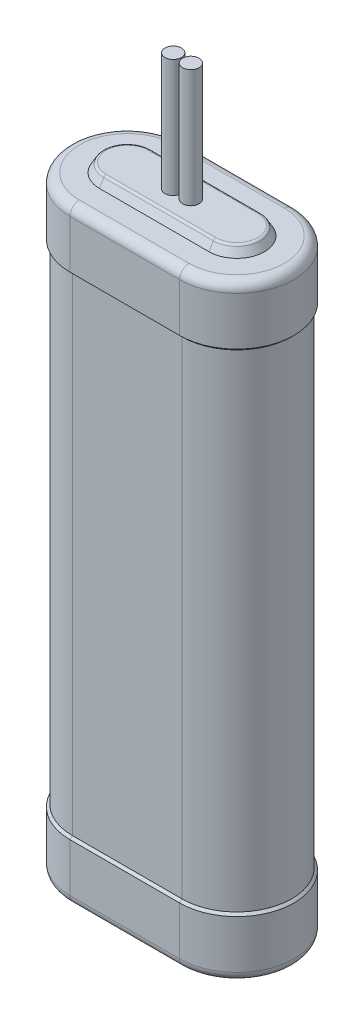
ISO-10303-21;
HEADER;
FILE_DESCRIPTION(('STEP AP214'),'2;1');
FILE_NAME('part.step','',(''),(''),'','','');
FILE_SCHEMA(('AUTOMOTIVE_DESIGN { 1 0 10303 214 1 1 1 1 }'));
ENDSEC;
DATA;
#1=APPLICATION_CONTEXT('core data for automotive mechanical design processes');
#2=APPLICATION_PROTOCOL_DEFINITION('international standard','automotive_design',2000,#1);
#3=PRODUCT_CONTEXT('',#1,'mechanical');
#4=PRODUCT('Part','Part','',(#3));
#5=PRODUCT_RELATED_PRODUCT_CATEGORY('part','',(#4));
#6=PRODUCT_DEFINITION_FORMATION('','',#4);
#7=PRODUCT_DEFINITION_CONTEXT('part definition',#1,'design');
#8=PRODUCT_DEFINITION('design','',#6,#7);
#9=PRODUCT_DEFINITION_SHAPE('','',#8);
#10=(LENGTH_UNIT() NAMED_UNIT(*) SI_UNIT(.MILLI.,.METRE.));
#11=(NAMED_UNIT(*) PLANE_ANGLE_UNIT() SI_UNIT($,.RADIAN.));
#12=(NAMED_UNIT(*) SI_UNIT($,.STERADIAN.) SOLID_ANGLE_UNIT());
#13=UNCERTAINTY_MEASURE_WITH_UNIT(LENGTH_MEASURE(1.E-05),#10,'distance_accuracy_value','');
#14=(GEOMETRIC_REPRESENTATION_CONTEXT(3) GLOBAL_UNCERTAINTY_ASSIGNED_CONTEXT((#13)) GLOBAL_UNIT_ASSIGNED_CONTEXT((#10,
#11,#12)) REPRESENTATION_CONTEXT('',''));
#15=CARTESIAN_POINT('',(0.,0.,0.));
#16=DIRECTION('',(0.,0.,1.));
#17=DIRECTION('',(1.,0.,0.));
#18=AXIS2_PLACEMENT_3D('',#15,#16,#17);
#19=CARTESIAN_POINT('',(-1.905,92.71,0.));
#20=DIRECTION('',(0.,1.,0.));
#21=DIRECTION('',(0.,0.,1.));
#22=AXIS2_PLACEMENT_3D('',#19,#20,#21);
#23=PLANE('',#22);
#24=CARTESIAN_POINT('',(-1.905,92.71,0.));
#25=DIRECTION('',(0.,-1.,0.));
#26=DIRECTION('',(0.,0.,-1.));
#27=AXIS2_PLACEMENT_3D('',#24,#25,#26);
#28=CIRCLE('',#27,1.778);
#29=CARTESIAN_POINT('',(-1.905,92.71,-1.778));
#30=VERTEX_POINT('',#29);
#31=EDGE_CURVE('E18',#30,#30,#28,.T.);
#32=ORIENTED_EDGE('',*,*,#31,.F.);
#33=EDGE_LOOP('',(#32));
#34=FACE_BOUND('',#33,.T.);
#35=ADVANCED_FACE('F14',(#34),#23,.T.);
#36=CARTESIAN_POINT('',(1.905,92.71,0.));
#37=DIRECTION('',(0.,1.,0.));
#38=DIRECTION('',(0.,0.,1.));
#39=AXIS2_PLACEMENT_3D('',#36,#37,#38);
#40=PLANE('',#39);
#41=CARTESIAN_POINT('',(1.905,92.71,0.));
#42=DIRECTION('',(0.,-1.,0.));
#43=DIRECTION('',(0.,0.,-1.));
#44=AXIS2_PLACEMENT_3D('',#41,#42,#43);
#45=CIRCLE('',#44,1.778);
#46=CARTESIAN_POINT('',(1.905,92.71,-1.778));
#47=VERTEX_POINT('',#46);
#48=EDGE_CURVE('E179',#47,#47,#45,.T.);
#49=ORIENTED_EDGE('',*,*,#48,.F.);
#50=EDGE_LOOP('',(#49));
#51=FACE_BOUND('',#50,.T.);
#52=ADVANCED_FACE('F189',(#51),#40,.T.);
#53=CARTESIAN_POINT('',(-1.905,92.71,0.));
#54=DIRECTION('',(0.,-1.,0.));
#55=DIRECTION('',(0.,0.,-1.));
#56=AXIS2_PLACEMENT_3D('',#53,#54,#55);
#57=CYLINDRICAL_SURFACE('',#56,1.778);
#58=CARTESIAN_POINT('',(-1.905,67.31,0.));
#59=DIRECTION('',(0.,-1.,0.));
#60=DIRECTION('',(0.,0.,-1.));
#61=AXIS2_PLACEMENT_3D('',#58,#59,#60);
#62=CIRCLE('',#61,1.778);
#63=CARTESIAN_POINT('',(-1.905,67.31,-1.778));
#64=VERTEX_POINT('',#63);
#65=EDGE_CURVE('E177',#64,#64,#62,.T.);
#66=ORIENTED_EDGE('',*,*,#65,.F.);
#67=EDGE_LOOP('',(#66));
#68=FACE_BOUND('',#67,.T.);
#69=ORIENTED_EDGE('',*,*,#31,.T.);
#70=EDGE_LOOP('',(#69));
#71=FACE_BOUND('',#70,.T.);
#72=ADVANCED_FACE('F186',(#68,#71),#57,.T.);
#73=CARTESIAN_POINT('',(1.905,92.71,0.));
#74=DIRECTION('',(0.,-1.,0.));
#75=DIRECTION('',(0.,0.,-1.));
#76=AXIS2_PLACEMENT_3D('',#73,#74,#75);
#77=CYLINDRICAL_SURFACE('',#76,1.778);
#78=CARTESIAN_POINT('',(1.905,67.31,0.));
#79=DIRECTION('',(0.,-1.,0.));
#80=DIRECTION('',(0.,0.,-1.));
#81=AXIS2_PLACEMENT_3D('',#78,#79,#80);
#82=CIRCLE('',#81,1.778);
#83=CARTESIAN_POINT('',(1.905,67.31,-1.778));
#84=VERTEX_POINT('',#83);
#85=EDGE_CURVE('E173',#84,#84,#82,.T.);
#86=ORIENTED_EDGE('',*,*,#85,.F.);
#87=EDGE_LOOP('',(#86));
#88=FACE_BOUND('',#87,.T.);
#89=ORIENTED_EDGE('',*,*,#48,.T.);
#90=EDGE_LOOP('',(#89));
#91=FACE_BOUND('',#90,.T.);
#92=ADVANCED_FACE('F695',(#88,#91),#77,.T.);
#93=CARTESIAN_POINT('',(11.811,67.31,0.));
#94=DIRECTION('',(0.,1.,0.));
#95=DIRECTION('',(0.,0.,1.));
#96=AXIS2_PLACEMENT_3D('',#93,#94,#95);
#97=PLANE('',#96);
#98=ORIENTED_EDGE('',*,*,#85,.T.);
#99=EDGE_LOOP('',(#98));
#100=FACE_BOUND('',#99,.T.);
#101=CARTESIAN_POINT('',(11.811,67.31,0.));
#102=DIRECTION('',(0.,-1.,0.));
#103=DIRECTION('',(0.,0.,-1.));
#104=AXIS2_PLACEMENT_3D('',#101,#102,#103);
#105=CIRCLE('',#104,4.50253031625843);
#106=CARTESIAN_POINT('',(11.811,67.31,-4.50253031625843));
#107=VERTEX_POINT('',#106);
#108=CARTESIAN_POINT('',(11.811,67.31,4.50253031625843));
#109=VERTEX_POINT('',#108);
#110=EDGE_CURVE('E626',#107,#109,#105,.T.);
#111=ORIENTED_EDGE('',*,*,#110,.F.);
#112=DIRECTION('',(-1.,0.,0.));
#113=VECTOR('',#112,1.);
#114=CARTESIAN_POINT('',(11.811,67.31,-4.50253031625843));
#115=LINE('',#114,#113);
#116=CARTESIAN_POINT('',(-11.811,67.31,-4.50253031625843));
#117=VERTEX_POINT('',#116);
#118=EDGE_CURVE('E176',#117,#107,#115,.F.);
#119=ORIENTED_EDGE('',*,*,#118,.F.);
#120=CARTESIAN_POINT('',(-11.811,67.31,0.));
#121=DIRECTION('',(0.,-1.,0.));
#122=DIRECTION('',(0.,0.,1.));
#123=AXIS2_PLACEMENT_3D('',#120,#121,#122);
#124=CIRCLE('',#123,4.50253031625843);
#125=CARTESIAN_POINT('',(-11.811,67.31,4.50253031625843));
#126=VERTEX_POINT('',#125);
#127=EDGE_CURVE('E613',#126,#117,#124,.T.);
#128=ORIENTED_EDGE('',*,*,#127,.F.);
#129=DIRECTION('',(1.,0.,0.));
#130=VECTOR('',#129,1.);
#131=CARTESIAN_POINT('',(11.811,67.31,4.50253031625843));
#132=LINE('',#131,#130);
#133=EDGE_CURVE('E638',#109,#126,#132,.F.);
#134=ORIENTED_EDGE('',*,*,#133,.F.);
#135=EDGE_LOOP('',(#111,#119,#128,#134));
#136=FACE_BOUND('',#135,.T.);
#137=ORIENTED_EDGE('',*,*,#65,.T.);
#138=EDGE_LOOP('',(#137));
#139=FACE_BOUND('',#138,.T.);
#140=ADVANCED_FACE('F681',(#100,#136,#139),#97,.T.);
#141=CARTESIAN_POINT('',(11.811,66.675,-4.50253031625843));
#142=DIRECTION('',(-1.,0.,0.));
#143=DIRECTION('',(0.,0.,1.));
#144=AXIS2_PLACEMENT_3D('',#141,#142,#143);
#145=CYLINDRICAL_SURFACE('',#144,0.635);
#146=CARTESIAN_POINT('',(-11.811,66.675,-4.50253031625843));
#147=DIRECTION('',(-1.,0.,0.));
#148=DIRECTION('',(0.,0.,-1.));
#149=AXIS2_PLACEMENT_3D('',#146,#147,#148);
#150=CIRCLE('',#149,0.635);
#151=CARTESIAN_POINT('',(-11.811,66.9925000000415,-5.05245644764532));
#152=VERTEX_POINT('',#151);
#153=EDGE_CURVE('E679',#117,#152,#150,.T.);
#154=ORIENTED_EDGE('',*,*,#153,.F.);
#155=ORIENTED_EDGE('',*,*,#118,.T.);
#156=CARTESIAN_POINT('',(11.811,66.675,-4.50253031625843));
#157=DIRECTION('',(-1.,0.,0.));
#158=DIRECTION('',(0.,0.,-1.));
#159=AXIS2_PLACEMENT_3D('',#156,#157,#158);
#160=CIRCLE('',#159,0.635);
#161=CARTESIAN_POINT('',(11.811,66.9924999999763,-5.05245644767858));
#162=VERTEX_POINT('',#161);
#163=EDGE_CURVE('E617',#162,#107,#160,.F.);
#164=ORIENTED_EDGE('',*,*,#163,.F.);
#165=DIRECTION('',(1.,0.,0.));
#166=VECTOR('',#165,1.);
#167=CARTESIAN_POINT('',(11.811,66.9925,-5.05245644766155));
#168=LINE('',#167,#166);
#169=EDGE_CURVE('E417',#152,#162,#168,.T.);
#170=ORIENTED_EDGE('',*,*,#169,.F.);
#171=EDGE_LOOP('',(#154,#155,#164,#170));
#172=FACE_BOUND('',#171,.T.);
#173=ADVANCED_FACE('F664',(#172),#145,.T.);
#174=CARTESIAN_POINT('',(11.811,66.675,0.));
#175=DIRECTION('',(0.,1.,0.));
#176=DIRECTION('',(0.,0.,1.));
#177=AXIS2_PLACEMENT_3D('',#174,#175,#176);
#178=TOROIDAL_SURFACE('',#177,4.50253031625843,0.635);
#179=CARTESIAN_POINT('',(11.811,66.675,4.50253031625843));
#180=DIRECTION('',(1.,0.,0.));
#181=DIRECTION('',(0.,0.,-1.));
#182=AXIS2_PLACEMENT_3D('',#179,#180,#181);
#183=CIRCLE('',#182,0.635);
#184=CARTESIAN_POINT('',(11.811,66.9924999999923,5.05245644766765));
#185=VERTEX_POINT('',#184);
#186=EDGE_CURVE('E619',#185,#109,#183,.F.);
#187=ORIENTED_EDGE('',*,*,#186,.F.);
#188=CARTESIAN_POINT('',(11.811,66.9924999999694,0.));
#189=DIRECTION('',(0.,-1.,0.));
#190=DIRECTION('',(0.,0.,-1.));
#191=AXIS2_PLACEMENT_3D('',#188,#189,#190);
#192=CIRCLE('',#191,5.05245644768593);
#193=EDGE_CURVE('E148',#162,#185,#192,.T.);
#194=ORIENTED_EDGE('',*,*,#193,.F.);
#195=ORIENTED_EDGE('',*,*,#163,.T.);
#196=ORIENTED_EDGE('',*,*,#110,.T.);
#197=EDGE_LOOP('',(#187,#194,#195,#196));
#198=FACE_BOUND('',#197,.T.);
#199=ADVANCED_FACE('F616',(#198),#178,.T.);
#200=CARTESIAN_POINT('',(11.811,66.675,4.50253031625843));
#201=DIRECTION('',(1.,0.,0.));
#202=DIRECTION('',(0.,0.,-1.));
#203=AXIS2_PLACEMENT_3D('',#200,#201,#202);
#204=CYLINDRICAL_SURFACE('',#203,0.635);
#205=ORIENTED_EDGE('',*,*,#186,.T.);
#206=ORIENTED_EDGE('',*,*,#133,.T.);
#207=CARTESIAN_POINT('',(-11.811,66.675,4.50253031625843));
#208=DIRECTION('',(1.,0.,0.));
#209=DIRECTION('',(0.,0.,1.));
#210=AXIS2_PLACEMENT_3D('',#207,#208,#209);
#211=CIRCLE('',#210,0.635);
#212=CARTESIAN_POINT('',(-11.811,66.9925000000606,5.0524564476343));
#213=VERTEX_POINT('',#212);
#214=EDGE_CURVE('E974',#213,#126,#211,.F.);
#215=ORIENTED_EDGE('',*,*,#214,.F.);
#216=DIRECTION('',(1.,0.,0.));
#217=VECTOR('',#216,1.);
#218=CARTESIAN_POINT('',(11.811,66.9925,5.05245644766155));
#219=LINE('',#218,#217);
#220=EDGE_CURVE('E152',#185,#213,#219,.F.);
#221=ORIENTED_EDGE('',*,*,#220,.F.);
#222=EDGE_LOOP('',(#205,#206,#215,#221));
#223=FACE_BOUND('',#222,.T.);
#224=ADVANCED_FACE('F650',(#223),#204,.T.);
#225=CARTESIAN_POINT('',(-11.811,66.675,0.));
#226=DIRECTION('',(0.,1.,0.));
#227=DIRECTION('',(0.,0.,1.));
#228=AXIS2_PLACEMENT_3D('',#225,#226,#227);
#229=TOROIDAL_SURFACE('',#228,4.50253031625843,0.635);
#230=ORIENTED_EDGE('',*,*,#214,.T.);
#231=ORIENTED_EDGE('',*,*,#127,.T.);
#232=ORIENTED_EDGE('',*,*,#153,.T.);
#233=CARTESIAN_POINT('',(-11.811,66.9924999999694,0.));
#234=DIRECTION('',(0.,-1.,0.));
#235=DIRECTION('',(0.,0.,-1.));
#236=AXIS2_PLACEMENT_3D('',#233,#234,#235);
#237=CIRCLE('',#236,5.05245644768593);
#238=EDGE_CURVE('E414',#213,#152,#237,.T.);
#239=ORIENTED_EDGE('',*,*,#238,.F.);
#240=EDGE_LOOP('',(#230,#231,#232,#239));
#241=FACE_BOUND('',#240,.T.);
#242=ADVANCED_FACE('F640',(#241),#229,.T.);
#243=CARTESIAN_POINT('',(11.811,67.31,-4.86914773719385));
#244=DIRECTION('',(0.,0.499999999999993,-0.866025403784443));
#245=DIRECTION('',(0.,0.866025403784443,0.499999999999993));
#246=AXIS2_PLACEMENT_3D('',#243,#244,#245);
#247=PLANE('',#246);
#248=DIRECTION('',(0.,0.866025403784443,0.499999999999993));
#249=VECTOR('',#248,1.);
#250=CARTESIAN_POINT('',(11.811,-499000.,-288141.514919974));
#251=LINE('',#250,#249);
#252=CARTESIAN_POINT('',(11.811,65.4050000000414,-5.96899999999492));
#253=VERTEX_POINT('',#252);
#254=EDGE_CURVE('E135',#253,#162,#251,.T.);
#255=ORIENTED_EDGE('',*,*,#254,.F.);
#256=DIRECTION('',(1.,0.,0.));
#257=VECTOR('',#256,1.);
#258=CARTESIAN_POINT('',(-11.811,65.405,-5.969));
#259=LINE('',#258,#257);
#260=CARTESIAN_POINT('',(-11.811,65.405000000084,-5.96899999996989));
#261=VERTEX_POINT('',#260);
#262=EDGE_CURVE('E166',#261,#253,#259,.T.);
#263=ORIENTED_EDGE('',*,*,#262,.F.);
#264=DIRECTION('',(0.,0.866025403784443,0.499999999999992));
#265=VECTOR('',#264,1.);
#266=CARTESIAN_POINT('',(-11.811,-499000.,-288141.514919974));
#267=LINE('',#266,#265);
#268=EDGE_CURVE('E411',#152,#261,#267,.F.);
#269=ORIENTED_EDGE('',*,*,#268,.F.);
#270=ORIENTED_EDGE('',*,*,#169,.T.);
#271=EDGE_LOOP('',(#255,#263,#269,#270));
#272=FACE_BOUND('',#271,.T.);
#273=ADVANCED_FACE('F609',(#272),#247,.T.);
#274=CARTESIAN_POINT('',(11.811,65.4050000000552,0.));
#275=DIRECTION('',(0.,-1.,0.));
#276=DIRECTION('',(0.,0.,-1.));
#277=AXIS2_PLACEMENT_3D('',#274,#275,#276);
#278=CONICAL_SURFACE('',#277,5.96899999999323,0.523598775606964);
#279=DIRECTION('',(0.,-0.866025403784443,0.499999999999993));
#280=VECTOR('',#279,1.);
#281=CARTESIAN_POINT('',(11.811,67.31,4.86914773719385));
#282=LINE('',#281,#280);
#283=CARTESIAN_POINT('',(11.811,65.4050000000276,5.96899999998411));
#284=VERTEX_POINT('',#283);
#285=EDGE_CURVE('E141',#284,#185,#282,.F.);
#286=ORIENTED_EDGE('',*,*,#285,.F.);
#287=CARTESIAN_POINT('',(11.811,65.4050000000552,0.));
#288=DIRECTION('',(0.,-1.,0.));
#289=DIRECTION('',(0.,0.,-1.));
#290=AXIS2_PLACEMENT_3D('',#287,#288,#289);
#291=CIRCLE('',#290,5.96899999999323);
#292=EDGE_CURVE('E145',#253,#284,#291,.T.);
#293=ORIENTED_EDGE('',*,*,#292,.F.);
#294=ORIENTED_EDGE('',*,*,#254,.T.);
#295=ORIENTED_EDGE('',*,*,#193,.T.);
#296=EDGE_LOOP('',(#286,#293,#294,#295));
#297=FACE_BOUND('',#296,.T.);
#298=ADVANCED_FACE('F143',(#297),#278,.T.);
#299=CARTESIAN_POINT('',(11.811,67.31,4.86914773719385));
#300=DIRECTION('',(0.,0.499999999999993,0.866025403784443));
#301=DIRECTION('',(0.,-0.866025403784443,0.499999999999993));
#302=AXIS2_PLACEMENT_3D('',#299,#300,#301);
#303=PLANE('',#302);
#304=DIRECTION('',(0.,0.866025403784443,-0.499999999999992));
#305=VECTOR('',#304,1.);
#306=CARTESIAN_POINT('',(-11.8109999997088,-499000.,288141.514919974));
#307=LINE('',#306,#305);
#308=CARTESIAN_POINT('',(-11.811,65.4050000000414,5.96899999999492));
#309=VERTEX_POINT('',#308);
#310=EDGE_CURVE('E158',#309,#213,#307,.T.);
#311=ORIENTED_EDGE('',*,*,#310,.F.);
#312=DIRECTION('',(1.,0.,0.));
#313=VECTOR('',#312,1.);
#314=CARTESIAN_POINT('',(-11.811,65.405,5.96900000000001));
#315=LINE('',#314,#313);
#316=EDGE_CURVE('E155',#284,#309,#315,.F.);
#317=ORIENTED_EDGE('',*,*,#316,.F.);
#318=ORIENTED_EDGE('',*,*,#285,.T.);
#319=ORIENTED_EDGE('',*,*,#220,.T.);
#320=EDGE_LOOP('',(#311,#317,#318,#319));
#321=FACE_BOUND('',#320,.T.);
#322=ADVANCED_FACE('F156',(#321),#303,.T.);
#323=CARTESIAN_POINT('',(-11.811,65.4050000002258,0.));
#324=DIRECTION('',(0.,-1.,0.));
#325=DIRECTION('',(0.,0.,-1.));
#326=AXIS2_PLACEMENT_3D('',#323,#324,#325);
#327=CONICAL_SURFACE('',#326,5.96899999987954,0.523598775591459);
#328=ORIENTED_EDGE('',*,*,#268,.T.);
#329=CARTESIAN_POINT('',(-11.811,65.4050000000552,0.));
#330=DIRECTION('',(0.,-1.,0.));
#331=DIRECTION('',(0.,0.,-1.));
#332=AXIS2_PLACEMENT_3D('',#329,#330,#331);
#333=CIRCLE('',#332,5.968999999978);
#334=EDGE_CURVE('E162',#309,#261,#333,.T.);
#335=ORIENTED_EDGE('',*,*,#334,.F.);
#336=ORIENTED_EDGE('',*,*,#310,.T.);
#337=ORIENTED_EDGE('',*,*,#238,.T.);
#338=EDGE_LOOP('',(#328,#335,#336,#337));
#339=FACE_BOUND('',#338,.T.);
#340=ADVANCED_FACE('F605',(#339),#327,.T.);
#341=CARTESIAN_POINT('',(-11.811,-63.373,0.));
#342=DIRECTION('',(0.,1.,0.));
#343=DIRECTION('',(0.,0.,1.));
#344=AXIS2_PLACEMENT_3D('',#341,#342,#343);
#345=TOROIDAL_SURFACE('',#344,10.287,2.032);
#346=CARTESIAN_POINT('',(-11.811,-63.373,10.287));
#347=DIRECTION('',(1.,0.,0.));
#348=DIRECTION('',(0.,0.,-1.));
#349=AXIS2_PLACEMENT_3D('',#346,#347,#348);
#350=CIRCLE('',#349,2.032);
#351=CARTESIAN_POINT('',(-11.811,-63.373,12.319));
#352=VERTEX_POINT('',#351);
#353=CARTESIAN_POINT('',(-11.811,-65.405,10.287));
#354=VERTEX_POINT('',#353);
#355=EDGE_CURVE('E510',#352,#354,#350,.T.);
#356=ORIENTED_EDGE('',*,*,#355,.F.);
#357=CARTESIAN_POINT('',(-11.811,-63.373,0.));
#358=DIRECTION('',(0.,-1.,0.));
#359=DIRECTION('',(0.,0.,-1.));
#360=AXIS2_PLACEMENT_3D('',#357,#358,#359);
#361=CIRCLE('',#360,12.319);
#362=CARTESIAN_POINT('',(-11.811,-63.373,-12.319));
#363=VERTEX_POINT('',#362);
#364=EDGE_CURVE('E504',#363,#352,#361,.F.);
#365=ORIENTED_EDGE('',*,*,#364,.F.);
#366=CARTESIAN_POINT('',(-11.811,-63.373,-10.287));
#367=DIRECTION('',(-1.,0.,0.));
#368=DIRECTION('',(0.,0.,1.));
#369=AXIS2_PLACEMENT_3D('',#366,#367,#368);
#370=CIRCLE('',#369,2.032);
#371=CARTESIAN_POINT('',(-11.811,-65.405,-10.287));
#372=VERTEX_POINT('',#371);
#373=EDGE_CURVE('E508',#372,#363,#370,.F.);
#374=ORIENTED_EDGE('',*,*,#373,.F.);
#375=CARTESIAN_POINT('',(-11.811,-65.405,0.));
#376=DIRECTION('',(0.,1.,0.));
#377=DIRECTION('',(0.,0.,-1.));
#378=AXIS2_PLACEMENT_3D('',#375,#376,#377);
#379=CIRCLE('',#378,10.287);
#380=EDGE_CURVE('E475',#372,#354,#379,.T.);
#381=ORIENTED_EDGE('',*,*,#380,.T.);
#382=EDGE_LOOP('',(#356,#365,#374,#381));
#383=FACE_BOUND('',#382,.T.);
#384=ADVANCED_FACE('F438',(#383),#345,.T.);
#385=CARTESIAN_POINT('',(-11.811,63.373,0.));
#386=DIRECTION('',(0.,1.,0.));
#387=DIRECTION('',(0.,0.,1.));
#388=AXIS2_PLACEMENT_3D('',#385,#386,#387);
#389=TOROIDAL_SURFACE('',#388,10.287,2.032);
#390=CARTESIAN_POINT('',(-11.811,63.373,-10.287));
#391=DIRECTION('',(-1.,0.,0.));
#392=DIRECTION('',(0.,0.,1.));
#393=AXIS2_PLACEMENT_3D('',#390,#391,#392);
#394=CIRCLE('',#393,2.032);
#395=CARTESIAN_POINT('',(-11.811,63.373,-12.319));
#396=VERTEX_POINT('',#395);
#397=CARTESIAN_POINT('',(-11.811,65.405,-10.287));
#398=VERTEX_POINT('',#397);
#399=EDGE_CURVE('E568',#396,#398,#394,.F.);
#400=ORIENTED_EDGE('',*,*,#399,.F.);
#401=CARTESIAN_POINT('',(-11.811,63.373,0.));
#402=DIRECTION('',(0.,1.,0.));
#403=DIRECTION('',(0.,0.,1.));
#404=AXIS2_PLACEMENT_3D('',#401,#402,#403);
#405=CIRCLE('',#404,12.319);
#406=CARTESIAN_POINT('',(-11.811,63.373,12.319));
#407=VERTEX_POINT('',#406);
#408=EDGE_CURVE('E590',#407,#396,#405,.F.);
#409=ORIENTED_EDGE('',*,*,#408,.F.);
#410=CARTESIAN_POINT('',(-11.811,63.373,10.287));
#411=DIRECTION('',(1.,0.,0.));
#412=DIRECTION('',(0.,0.,-1.));
#413=AXIS2_PLACEMENT_3D('',#410,#411,#412);
#414=CIRCLE('',#413,2.032);
#415=CARTESIAN_POINT('',(-11.811,65.405,10.287));
#416=VERTEX_POINT('',#415);
#417=EDGE_CURVE('E516',#416,#407,#414,.T.);
#418=ORIENTED_EDGE('',*,*,#417,.F.);
#419=CARTESIAN_POINT('',(-11.811,65.405,0.));
#420=DIRECTION('',(0.,-1.,0.));
#421=DIRECTION('',(0.,0.,1.));
#422=AXIS2_PLACEMENT_3D('',#419,#420,#421);
#423=CIRCLE('',#422,10.287);
#424=EDGE_CURVE('E168',#398,#416,#423,.F.);
#425=ORIENTED_EDGE('',*,*,#424,.F.);
#426=EDGE_LOOP('',(#400,#409,#418,#425));
#427=FACE_BOUND('',#426,.T.);
#428=ADVANCED_FACE('F427',(#427),#389,.T.);
#429=CARTESIAN_POINT('',(-11.811,65.405,0.));
#430=DIRECTION('',(0.,1.,0.));
#431=DIRECTION('',(0.,0.,1.));
#432=AXIS2_PLACEMENT_3D('',#429,#430,#431);
#433=PLANE('',#432);
#434=ORIENTED_EDGE('',*,*,#316,.T.);
#435=ORIENTED_EDGE('',*,*,#334,.T.);
#436=ORIENTED_EDGE('',*,*,#262,.T.);
#437=ORIENTED_EDGE('',*,*,#292,.T.);
#438=EDGE_LOOP('',(#434,#435,#436,#437));
#439=FACE_BOUND('',#438,.T.);
#440=DIRECTION('',(-1.,0.,0.));
#441=VECTOR('',#440,1.);
#442=CARTESIAN_POINT('',(-11.811,65.405,-10.287));
#443=LINE('',#442,#441);
#444=CARTESIAN_POINT('',(11.811,65.405,-10.287));
#445=VERTEX_POINT('',#444);
#446=EDGE_CURVE('E587',#398,#445,#443,.F.);
#447=ORIENTED_EDGE('',*,*,#446,.F.);
#448=ORIENTED_EDGE('',*,*,#424,.T.);
#449=DIRECTION('',(1.,0.,0.));
#450=VECTOR('',#449,1.);
#451=CARTESIAN_POINT('',(11.811,65.405,10.287));
#452=LINE('',#451,#450);
#453=CARTESIAN_POINT('',(11.811,65.405,10.287));
#454=VERTEX_POINT('',#453);
#455=EDGE_CURVE('E513',#454,#416,#452,.F.);
#456=ORIENTED_EDGE('',*,*,#455,.F.);
#457=CARTESIAN_POINT('',(11.811,65.405,0.));
#458=DIRECTION('',(0.,-1.,0.));
#459=DIRECTION('',(0.,0.,-1.));
#460=AXIS2_PLACEMENT_3D('',#457,#458,#459);
#461=CIRCLE('',#460,10.287);
#462=EDGE_CURVE('E451',#445,#454,#461,.T.);
#463=ORIENTED_EDGE('',*,*,#462,.F.);
#464=EDGE_LOOP('',(#447,#448,#456,#463));
#465=FACE_BOUND('',#464,.T.);
#466=ADVANCED_FACE('F164',(#439,#465),#433,.T.);
#467=CARTESIAN_POINT('',(11.811,63.373,10.287));
#468=DIRECTION('',(1.,0.,0.));
#469=DIRECTION('',(0.,0.,-1.));
#470=AXIS2_PLACEMENT_3D('',#467,#468,#469);
#471=CYLINDRICAL_SURFACE('',#470,2.032);
#472=CARTESIAN_POINT('',(11.811,63.373,10.287));
#473=DIRECTION('',(1.,0.,0.));
#474=DIRECTION('',(0.,0.,1.));
#475=AXIS2_PLACEMENT_3D('',#472,#473,#474);
#476=CIRCLE('',#475,2.032);
#477=CARTESIAN_POINT('',(11.811,63.373,12.319));
#478=VERTEX_POINT('',#477);
#479=EDGE_CURVE('E405',#454,#478,#476,.T.);
#480=ORIENTED_EDGE('',*,*,#479,.F.);
#481=ORIENTED_EDGE('',*,*,#455,.T.);
#482=ORIENTED_EDGE('',*,*,#417,.T.);
#483=DIRECTION('',(-1.,0.,0.));
#484=VECTOR('',#483,1.);
#485=CARTESIAN_POINT('',(11.811,63.373,12.319));
#486=LINE('',#485,#484);
#487=EDGE_CURVE('E399',#407,#478,#486,.F.);
#488=ORIENTED_EDGE('',*,*,#487,.T.);
#489=EDGE_LOOP('',(#480,#481,#482,#488));
#490=FACE_BOUND('',#489,.T.);
#491=ADVANCED_FACE('F876',(#490),#471,.T.);
#492=CARTESIAN_POINT('',(-11.811,-63.373,10.287));
#493=DIRECTION('',(1.,0.,0.));
#494=DIRECTION('',(0.,0.,-1.));
#495=AXIS2_PLACEMENT_3D('',#492,#493,#494);
#496=CYLINDRICAL_SURFACE('',#495,2.032);
#497=ORIENTED_EDGE('',*,*,#355,.T.);
#498=DIRECTION('',(1.,0.,0.));
#499=VECTOR('',#498,1.);
#500=CARTESIAN_POINT('',(-11.811,-65.405,10.287));
#501=LINE('',#500,#499);
#502=CARTESIAN_POINT('',(11.811,-65.405,10.287));
#503=VERTEX_POINT('',#502);
#504=EDGE_CURVE('E498',#354,#503,#501,.T.);
#505=ORIENTED_EDGE('',*,*,#504,.T.);
#506=CARTESIAN_POINT('',(11.811,-63.373,10.287));
#507=DIRECTION('',(1.,0.,0.));
#508=DIRECTION('',(0.,0.,1.));
#509=AXIS2_PLACEMENT_3D('',#506,#507,#508);
#510=CIRCLE('',#509,2.032);
#511=CARTESIAN_POINT('',(11.811,-63.373,12.319));
#512=VERTEX_POINT('',#511);
#513=EDGE_CURVE('E234',#512,#503,#510,.T.);
#514=ORIENTED_EDGE('',*,*,#513,.F.);
#515=DIRECTION('',(1.,0.,0.));
#516=VECTOR('',#515,1.);
#517=CARTESIAN_POINT('',(11.811,-63.373,12.319));
#518=LINE('',#517,#516);
#519=EDGE_CURVE('E403',#352,#512,#518,.T.);
#520=ORIENTED_EDGE('',*,*,#519,.F.);
#521=EDGE_LOOP('',(#497,#505,#514,#520));
#522=FACE_BOUND('',#521,.T.);
#523=ADVANCED_FACE('F492',(#522),#496,.T.);
#524=CARTESIAN_POINT('',(-11.811,-65.405,0.));
#525=DIRECTION('',(0.,1.,0.));
#526=DIRECTION('',(0.,0.,1.));
#527=AXIS2_PLACEMENT_3D('',#524,#525,#526);
#528=PLANE('',#527);
#529=ORIENTED_EDGE('',*,*,#504,.F.);
#530=ORIENTED_EDGE('',*,*,#380,.F.);
#531=DIRECTION('',(-1.,0.,0.));
#532=VECTOR('',#531,1.);
#533=CARTESIAN_POINT('',(-11.811,-65.405,-10.287));
#534=LINE('',#533,#532);
#535=CARTESIAN_POINT('',(11.811,-65.405,-10.287));
#536=VERTEX_POINT('',#535);
#537=EDGE_CURVE('E566',#536,#372,#534,.T.);
#538=ORIENTED_EDGE('',*,*,#537,.F.);
#539=CARTESIAN_POINT('',(11.811,-65.405,0.));
#540=DIRECTION('',(0.,1.,0.));
#541=DIRECTION('',(0.,0.,1.));
#542=AXIS2_PLACEMENT_3D('',#539,#540,#541);
#543=CIRCLE('',#542,10.287);
#544=EDGE_CURVE('E229',#503,#536,#543,.T.);
#545=ORIENTED_EDGE('',*,*,#544,.F.);
#546=EDGE_LOOP('',(#529,#530,#538,#545));
#547=FACE_BOUND('',#546,.T.);
#548=ADVANCED_FACE('F482',(#547),#528,.F.);
#549=CARTESIAN_POINT('',(-11.811,-52.451,0.));
#550=DIRECTION('',(0.,-1.,0.));
#551=DIRECTION('',(0.,0.,-1.));
#552=AXIS2_PLACEMENT_3D('',#549,#550,#551);
#553=CYLINDRICAL_SURFACE('',#552,12.319);
#554=DIRECTION('',(0.,1.,0.));
#555=VECTOR('',#554,1.);
#556=CARTESIAN_POINT('',(-11.811,-52.451,-12.319));
#557=LINE('',#556,#555);
#558=CARTESIAN_POINT('',(-11.811,-52.959,-12.319));
#559=VERTEX_POINT('',#558);
#560=EDGE_CURVE('E360',#363,#559,#557,.T.);
#561=ORIENTED_EDGE('',*,*,#560,.F.);
#562=ORIENTED_EDGE('',*,*,#364,.T.);
#563=DIRECTION('',(0.,1.,0.));
#564=VECTOR('',#563,1.);
#565=CARTESIAN_POINT('',(-11.811,-52.451,12.319));
#566=LINE('',#565,#564);
#567=CARTESIAN_POINT('',(-11.811,-52.959,12.319));
#568=VERTEX_POINT('',#567);
#569=EDGE_CURVE('E363',#568,#352,#566,.F.);
#570=ORIENTED_EDGE('',*,*,#569,.F.);
#571=CARTESIAN_POINT('',(-11.811,-52.959,0.));
#572=DIRECTION('',(0.,-1.,0.));
#573=DIRECTION('',(0.,0.,-1.));
#574=AXIS2_PLACEMENT_3D('',#571,#572,#573);
#575=CIRCLE('',#574,12.319);
#576=EDGE_CURVE('E265',#559,#568,#575,.F.);
#577=ORIENTED_EDGE('',*,*,#576,.F.);
#578=EDGE_LOOP('',(#561,#562,#570,#577));
#579=FACE_BOUND('',#578,.T.);
#580=ADVANCED_FACE('F357',(#579),#553,.T.);
#581=CARTESIAN_POINT('',(-11.811,-63.373,-10.287));
#582=DIRECTION('',(-1.,0.,0.));
#583=DIRECTION('',(0.,0.,1.));
#584=AXIS2_PLACEMENT_3D('',#581,#582,#583);
#585=CYLINDRICAL_SURFACE('',#584,2.032);
#586=CARTESIAN_POINT('',(11.811,-63.373,-10.287));
#587=DIRECTION('',(-1.,0.,0.));
#588=DIRECTION('',(0.,0.,-1.));
#589=AXIS2_PLACEMENT_3D('',#586,#587,#588);
#590=CIRCLE('',#589,2.032);
#591=CARTESIAN_POINT('',(11.811,-63.373,-12.319));
#592=VERTEX_POINT('',#591);
#593=EDGE_CURVE('E978',#536,#592,#590,.F.);
#594=ORIENTED_EDGE('',*,*,#593,.F.);
#595=ORIENTED_EDGE('',*,*,#537,.T.);
#596=ORIENTED_EDGE('',*,*,#373,.T.);
#597=DIRECTION('',(-1.,0.,0.));
#598=VECTOR('',#597,1.);
#599=CARTESIAN_POINT('',(-11.811,-63.373,-12.319));
#600=LINE('',#599,#598);
#601=EDGE_CURVE('E373',#592,#363,#600,.T.);
#602=ORIENTED_EDGE('',*,*,#601,.F.);
#603=EDGE_LOOP('',(#594,#595,#596,#602));
#604=FACE_BOUND('',#603,.T.);
#605=ADVANCED_FACE('F772',(#604),#585,.T.);
#606=CARTESIAN_POINT('',(-11.811,63.373,-10.287));
#607=DIRECTION('',(-1.,0.,0.));
#608=DIRECTION('',(0.,0.,1.));
#609=AXIS2_PLACEMENT_3D('',#606,#607,#608);
#610=CYLINDRICAL_SURFACE('',#609,2.032);
#611=CARTESIAN_POINT('',(11.811,63.373,-10.287));
#612=DIRECTION('',(-1.,0.,0.));
#613=DIRECTION('',(0.,0.,-1.));
#614=AXIS2_PLACEMENT_3D('',#611,#612,#613);
#615=CIRCLE('',#614,2.032);
#616=CARTESIAN_POINT('',(11.811,63.373,-12.319));
#617=VERTEX_POINT('',#616);
#618=EDGE_CURVE('E531',#617,#445,#615,.F.);
#619=ORIENTED_EDGE('',*,*,#618,.F.);
#620=DIRECTION('',(1.,0.,0.));
#621=VECTOR('',#620,1.);
#622=CARTESIAN_POINT('',(-11.811,63.373,-12.319));
#623=LINE('',#622,#621);
#624=EDGE_CURVE('E570',#617,#396,#623,.F.);
#625=ORIENTED_EDGE('',*,*,#624,.T.);
#626=ORIENTED_EDGE('',*,*,#399,.T.);
#627=ORIENTED_EDGE('',*,*,#446,.T.);
#628=EDGE_LOOP('',(#619,#625,#626,#627));
#629=FACE_BOUND('',#628,.T.);
#630=ADVANCED_FACE('F740',(#629),#610,.T.);
#631=CARTESIAN_POINT('',(-11.811,52.451,0.));
#632=DIRECTION('',(0.,1.,0.));
#633=DIRECTION('',(0.,0.,1.));
#634=AXIS2_PLACEMENT_3D('',#631,#632,#633);
#635=CYLINDRICAL_SURFACE('',#634,12.319);
#636=DIRECTION('',(0.,1.,0.));
#637=VECTOR('',#636,1.);
#638=CARTESIAN_POINT('',(-11.811,52.451,12.319));
#639=LINE('',#638,#637);
#640=CARTESIAN_POINT('',(-11.811,52.959,12.319));
#641=VERTEX_POINT('',#640);
#642=EDGE_CURVE('E396',#641,#407,#639,.T.);
#643=ORIENTED_EDGE('',*,*,#642,.T.);
#644=ORIENTED_EDGE('',*,*,#408,.T.);
#645=DIRECTION('',(0.,1.,0.));
#646=VECTOR('',#645,1.);
#647=CARTESIAN_POINT('',(-11.811,52.451,-12.319));
#648=LINE('',#647,#646);
#649=CARTESIAN_POINT('',(-11.811,52.959,-12.319));
#650=VERTEX_POINT('',#649);
#651=EDGE_CURVE('E270',#396,#650,#648,.F.);
#652=ORIENTED_EDGE('',*,*,#651,.T.);
#653=CARTESIAN_POINT('',(-11.811,52.959,0.));
#654=DIRECTION('',(0.,1.,0.));
#655=DIRECTION('',(0.,0.,1.));
#656=AXIS2_PLACEMENT_3D('',#653,#654,#655);
#657=CIRCLE('',#656,12.319);
#658=EDGE_CURVE('E260',#641,#650,#657,.F.);
#659=ORIENTED_EDGE('',*,*,#658,.F.);
#660=EDGE_LOOP('',(#643,#644,#652,#659));
#661=FACE_BOUND('',#660,.T.);
#662=ADVANCED_FACE('F542',(#661),#635,.T.);
#663=CARTESIAN_POINT('',(11.811,63.373,0.));
#664=DIRECTION('',(0.,1.,0.));
#665=DIRECTION('',(0.,0.,1.));
#666=AXIS2_PLACEMENT_3D('',#663,#664,#665);
#667=TOROIDAL_SURFACE('',#666,10.287,2.032);
#668=ORIENTED_EDGE('',*,*,#479,.T.);
#669=CARTESIAN_POINT('',(11.811,63.373,0.));
#670=DIRECTION('',(0.,1.,0.));
#671=DIRECTION('',(0.,0.,1.));
#672=AXIS2_PLACEMENT_3D('',#669,#670,#671);
#673=CIRCLE('',#672,12.319);
#674=EDGE_CURVE('E380',#617,#478,#673,.F.);
#675=ORIENTED_EDGE('',*,*,#674,.F.);
#676=ORIENTED_EDGE('',*,*,#618,.T.);
#677=ORIENTED_EDGE('',*,*,#462,.T.);
#678=EDGE_LOOP('',(#668,#675,#676,#677));
#679=FACE_BOUND('',#678,.T.);
#680=ADVANCED_FACE('F533',(#679),#667,.T.);
#681=CARTESIAN_POINT('',(11.811,52.451,12.319));
#682=DIRECTION('',(0.,0.,-1.));
#683=DIRECTION('',(-1.,0.,0.));
#684=AXIS2_PLACEMENT_3D('',#681,#682,#683);
#685=PLANE('',#684);
#686=DIRECTION('',(1.,0.,0.));
#687=VECTOR('',#686,1.);
#688=CARTESIAN_POINT('',(11.811,52.959,12.319));
#689=LINE('',#688,#687);
#690=CARTESIAN_POINT('',(11.811,52.959,12.319));
#691=VERTEX_POINT('',#690);
#692=EDGE_CURVE('E275',#641,#691,#689,.T.);
#693=ORIENTED_EDGE('',*,*,#692,.T.);
#694=DIRECTION('',(0.,1.,0.));
#695=VECTOR('',#694,1.);
#696=CARTESIAN_POINT('',(11.811,52.451,12.319));
#697=LINE('',#696,#695);
#698=EDGE_CURVE('E266',#478,#691,#697,.F.);
#699=ORIENTED_EDGE('',*,*,#698,.F.);
#700=ORIENTED_EDGE('',*,*,#487,.F.);
#701=ORIENTED_EDGE('',*,*,#642,.F.);
#702=EDGE_LOOP('',(#693,#699,#700,#701));
#703=FACE_BOUND('',#702,.T.);
#704=ADVANCED_FACE('F397',(#703),#685,.F.);
#705=CARTESIAN_POINT('',(11.811,-52.451,12.319));
#706=DIRECTION('',(0.,0.,1.));
#707=DIRECTION('',(1.,0.,0.));
#708=AXIS2_PLACEMENT_3D('',#705,#706,#707);
#709=PLANE('',#708);
#710=ORIENTED_EDGE('',*,*,#569,.T.);
#711=ORIENTED_EDGE('',*,*,#519,.T.);
#712=DIRECTION('',(0.,-1.,0.));
#713=VECTOR('',#712,1.);
#714=CARTESIAN_POINT('',(11.811,-52.451,12.319));
#715=LINE('',#714,#713);
#716=CARTESIAN_POINT('',(11.811,-52.959,12.319));
#717=VERTEX_POINT('',#716);
#718=EDGE_CURVE('E558',#717,#512,#715,.T.);
#719=ORIENTED_EDGE('',*,*,#718,.F.);
#720=DIRECTION('',(1.,0.,0.));
#721=VECTOR('',#720,1.);
#722=CARTESIAN_POINT('',(11.811,-52.959,12.319));
#723=LINE('',#722,#721);
#724=EDGE_CURVE('E274',#568,#717,#723,.T.);
#725=ORIENTED_EDGE('',*,*,#724,.F.);
#726=EDGE_LOOP('',(#710,#711,#719,#725));
#727=FACE_BOUND('',#726,.T.);
#728=ADVANCED_FACE('F248',(#727),#709,.T.);
#729=CARTESIAN_POINT('',(11.811,-63.373,0.));
#730=DIRECTION('',(0.,1.,0.));
#731=DIRECTION('',(0.,0.,1.));
#732=AXIS2_PLACEMENT_3D('',#729,#730,#731);
#733=TOROIDAL_SURFACE('',#732,10.287,2.032);
#734=ORIENTED_EDGE('',*,*,#513,.T.);
#735=ORIENTED_EDGE('',*,*,#544,.T.);
#736=ORIENTED_EDGE('',*,*,#593,.T.);
#737=CARTESIAN_POINT('',(11.811,-63.373,0.));
#738=DIRECTION('',(0.,-1.,0.));
#739=DIRECTION('',(0.,0.,-1.));
#740=AXIS2_PLACEMENT_3D('',#737,#738,#739);
#741=CIRCLE('',#740,12.319);
#742=EDGE_CURVE('E288',#512,#592,#741,.F.);
#743=ORIENTED_EDGE('',*,*,#742,.F.);
#744=EDGE_LOOP('',(#734,#735,#736,#743));
#745=FACE_BOUND('',#744,.T.);
#746=ADVANCED_FACE('F236',(#745),#733,.T.);
#747=CARTESIAN_POINT('',(-11.811,52.959,0.));
#748=DIRECTION('',(0.,1.,0.));
#749=DIRECTION('',(-1.,0.,0.));
#750=AXIS2_PLACEMENT_3D('',#747,#748,#749);
#751=CONICAL_SURFACE('',#750,12.319,0.785398163397448);
#752=DIRECTION('',(0.,-0.707106781186548,0.707106781186547));
#753=VECTOR('',#752,1.);
#754=CARTESIAN_POINT('',(-11.811,52.451,-11.811));
#755=LINE('',#754,#753);
#756=CARTESIAN_POINT('',(-11.811,52.451,-11.811));
#757=VERTEX_POINT('',#756);
#758=EDGE_CURVE('E256',#650,#757,#755,.T.);
#759=ORIENTED_EDGE('',*,*,#758,.T.);
#760=CARTESIAN_POINT('',(-11.811,52.451,0.));
#761=DIRECTION('',(0.,-1.,0.));
#762=DIRECTION('',(0.,0.,-1.));
#763=AXIS2_PLACEMENT_3D('',#760,#761,#762);
#764=CIRCLE('',#763,11.811);
#765=CARTESIAN_POINT('',(-11.811,52.451,11.811));
#766=VERTEX_POINT('',#765);
#767=EDGE_CURVE('E285',#766,#757,#764,.T.);
#768=ORIENTED_EDGE('',*,*,#767,.F.);
#769=DIRECTION('',(0.,0.707106781186548,0.707106781186548));
#770=VECTOR('',#769,1.);
#771=CARTESIAN_POINT('',(-11.811,52.451,11.811));
#772=LINE('',#771,#770);
#773=EDGE_CURVE('E273',#766,#641,#772,.T.);
#774=ORIENTED_EDGE('',*,*,#773,.T.);
#775=ORIENTED_EDGE('',*,*,#658,.T.);
#776=EDGE_LOOP('',(#759,#768,#774,#775));
#777=FACE_BOUND('',#776,.T.);
#778=ADVANCED_FACE('F247',(#777),#751,.T.);
#779=CARTESIAN_POINT('',(-11.811,-52.959,0.));
#780=DIRECTION('',(0.,-1.,0.));
#781=DIRECTION('',(0.,0.,-1.));
#782=AXIS2_PLACEMENT_3D('',#779,#780,#781);
#783=CONICAL_SURFACE('',#782,12.319,0.785398163397448);
#784=DIRECTION('',(0.,0.707106781186548,0.707106781186547));
#785=VECTOR('',#784,1.);
#786=CARTESIAN_POINT('',(-11.811,-52.959,-12.319));
#787=LINE('',#786,#785);
#788=CARTESIAN_POINT('',(-11.811,-52.451,-11.811));
#789=VERTEX_POINT('',#788);
#790=EDGE_CURVE('E259',#789,#559,#787,.F.);
#791=ORIENTED_EDGE('',*,*,#790,.T.);
#792=ORIENTED_EDGE('',*,*,#576,.T.);
#793=DIRECTION('',(0.,-0.707106781186548,0.707106781186548));
#794=VECTOR('',#793,1.);
#795=CARTESIAN_POINT('',(-11.811,-52.959,12.319));
#796=LINE('',#795,#794);
#797=CARTESIAN_POINT('',(-11.811,-52.451,11.811));
#798=VERTEX_POINT('',#797);
#799=EDGE_CURVE('E377',#798,#568,#796,.T.);
#800=ORIENTED_EDGE('',*,*,#799,.F.);
#801=CARTESIAN_POINT('',(-11.811,-52.451,0.));
#802=DIRECTION('',(0.,-1.,0.));
#803=DIRECTION('',(0.,0.,-1.));
#804=AXIS2_PLACEMENT_3D('',#801,#802,#803);
#805=CIRCLE('',#804,11.811);
#806=EDGE_CURVE('E281',#789,#798,#805,.F.);
#807=ORIENTED_EDGE('',*,*,#806,.F.);
#808=EDGE_LOOP('',(#791,#792,#800,#807));
#809=FACE_BOUND('',#808,.T.);
#810=ADVANCED_FACE('F375',(#809),#783,.T.);
#811=CARTESIAN_POINT('',(-11.811,-52.451,-12.319));
#812=DIRECTION('',(0.,0.,-1.));
#813=DIRECTION('',(-1.,0.,0.));
#814=AXIS2_PLACEMENT_3D('',#811,#812,#813);
#815=PLANE('',#814);
#816=DIRECTION('',(0.,-1.,0.));
#817=VECTOR('',#816,1.);
#818=CARTESIAN_POINT('',(11.811,-52.451,-12.319));
#819=LINE('',#818,#817);
#820=CARTESIAN_POINT('',(11.811,-52.959,-12.319));
#821=VERTEX_POINT('',#820);
#822=EDGE_CURVE('E278',#592,#821,#819,.F.);
#823=ORIENTED_EDGE('',*,*,#822,.F.);
#824=ORIENTED_EDGE('',*,*,#601,.T.);
#825=ORIENTED_EDGE('',*,*,#560,.T.);
#826=DIRECTION('',(1.,0.,0.));
#827=VECTOR('',#826,1.);
#828=CARTESIAN_POINT('',(-11.811,-52.959,-12.319));
#829=LINE('',#828,#827);
#830=EDGE_CURVE('E284',#821,#559,#829,.F.);
#831=ORIENTED_EDGE('',*,*,#830,.F.);
#832=EDGE_LOOP('',(#823,#824,#825,#831));
#833=FACE_BOUND('',#832,.T.);
#834=ADVANCED_FACE('F372',(#833),#815,.T.);
#835=CARTESIAN_POINT('',(-11.811,52.451,-12.319));
#836=DIRECTION('',(0.,0.,1.));
#837=DIRECTION('',(1.,0.,0.));
#838=AXIS2_PLACEMENT_3D('',#835,#836,#837);
#839=PLANE('',#838);
#840=DIRECTION('',(1.,0.,0.));
#841=VECTOR('',#840,1.);
#842=CARTESIAN_POINT('',(11.811,52.959,-12.319));
#843=LINE('',#842,#841);
#844=CARTESIAN_POINT('',(11.811,52.959,-12.319));
#845=VERTEX_POINT('',#844);
#846=EDGE_CURVE('E291',#845,#650,#843,.F.);
#847=ORIENTED_EDGE('',*,*,#846,.T.);
#848=ORIENTED_EDGE('',*,*,#651,.F.);
#849=ORIENTED_EDGE('',*,*,#624,.F.);
#850=DIRECTION('',(0.,1.,0.));
#851=VECTOR('',#850,1.);
#852=CARTESIAN_POINT('',(11.811,52.451,-12.319));
#853=LINE('',#852,#851);
#854=EDGE_CURVE('E269',#845,#617,#853,.T.);
#855=ORIENTED_EDGE('',*,*,#854,.F.);
#856=EDGE_LOOP('',(#847,#848,#849,#855));
#857=FACE_BOUND('',#856,.T.);
#858=ADVANCED_FACE('F719',(#857),#839,.F.);
#859=CARTESIAN_POINT('',(11.811,52.451,0.));
#860=DIRECTION('',(0.,1.,0.));
#861=DIRECTION('',(0.,0.,1.));
#862=AXIS2_PLACEMENT_3D('',#859,#860,#861);
#863=CYLINDRICAL_SURFACE('',#862,12.319);
#864=ORIENTED_EDGE('',*,*,#854,.T.);
#865=ORIENTED_EDGE('',*,*,#674,.T.);
#866=ORIENTED_EDGE('',*,*,#698,.T.);
#867=CARTESIAN_POINT('',(11.811,52.959,0.));
#868=DIRECTION('',(0.,1.,0.));
#869=DIRECTION('',(0.,0.,1.));
#870=AXIS2_PLACEMENT_3D('',#867,#868,#869);
#871=CIRCLE('',#870,12.319);
#872=EDGE_CURVE('E299',#845,#691,#871,.F.);
#873=ORIENTED_EDGE('',*,*,#872,.F.);
#874=EDGE_LOOP('',(#864,#865,#866,#873));
#875=FACE_BOUND('',#874,.T.);
#876=ADVANCED_FACE('F723',(#875),#863,.T.);
#877=CARTESIAN_POINT('',(11.811,-52.959,12.319));
#878=DIRECTION('',(0.,0.707106781186548,0.707106781186548));
#879=DIRECTION('',(0.,-0.707106781186548,0.707106781186548));
#880=AXIS2_PLACEMENT_3D('',#877,#878,#879);
#881=PLANE('',#880);
#882=DIRECTION('',(0.,-0.707106781186548,0.707106781186548));
#883=VECTOR('',#882,1.);
#884=CARTESIAN_POINT('',(11.811,-52.959,12.319));
#885=LINE('',#884,#883);
#886=CARTESIAN_POINT('',(11.811,-52.451,11.811));
#887=VERTEX_POINT('',#886);
#888=EDGE_CURVE('E271',#717,#887,#885,.F.);
#889=ORIENTED_EDGE('',*,*,#888,.T.);
#890=DIRECTION('',(-1.,0.,0.));
#891=VECTOR('',#890,1.);
#892=CARTESIAN_POINT('',(-11.811,-52.451,11.811));
#893=LINE('',#892,#891);
#894=EDGE_CURVE('E298',#887,#798,#893,.T.);
#895=ORIENTED_EDGE('',*,*,#894,.T.);
#896=ORIENTED_EDGE('',*,*,#799,.T.);
#897=ORIENTED_EDGE('',*,*,#724,.T.);
#898=EDGE_LOOP('',(#889,#895,#896,#897));
#899=FACE_BOUND('',#898,.T.);
#900=ADVANCED_FACE('F383',(#899),#881,.T.);
#901=CARTESIAN_POINT('',(11.811,52.451,11.811));
#902=DIRECTION('',(0.,0.707106781186548,-0.707106781186548));
#903=DIRECTION('',(0.,0.707106781186548,0.707106781186548));
#904=AXIS2_PLACEMENT_3D('',#901,#902,#903);
#905=PLANE('',#904);
#906=ORIENTED_EDGE('',*,*,#692,.F.);
#907=ORIENTED_EDGE('',*,*,#773,.F.);
#908=DIRECTION('',(-1.,0.,0.));
#909=VECTOR('',#908,1.);
#910=CARTESIAN_POINT('',(-11.811,52.451,11.811));
#911=LINE('',#910,#909);
#912=CARTESIAN_POINT('',(11.811,52.451,11.811));
#913=VERTEX_POINT('',#912);
#914=EDGE_CURVE('E304',#766,#913,#911,.F.);
#915=ORIENTED_EDGE('',*,*,#914,.T.);
#916=DIRECTION('',(0.,-0.707106781186547,-0.707106781186548));
#917=VECTOR('',#916,1.);
#918=CARTESIAN_POINT('',(11.811,52.451,11.811));
#919=LINE('',#918,#917);
#920=EDGE_CURVE('E295',#691,#913,#919,.T.);
#921=ORIENTED_EDGE('',*,*,#920,.F.);
#922=EDGE_LOOP('',(#906,#907,#915,#921));
#923=FACE_BOUND('',#922,.T.);
#924=ADVANCED_FACE('F390',(#923),#905,.F.);
#925=CARTESIAN_POINT('',(11.811,-52.451,0.));
#926=DIRECTION('',(0.,-1.,0.));
#927=DIRECTION('',(0.,0.,-1.));
#928=AXIS2_PLACEMENT_3D('',#925,#926,#927);
#929=CYLINDRICAL_SURFACE('',#928,12.319);
#930=ORIENTED_EDGE('',*,*,#718,.T.);
#931=ORIENTED_EDGE('',*,*,#742,.T.);
#932=ORIENTED_EDGE('',*,*,#822,.T.);
#933=CARTESIAN_POINT('',(11.811,-52.959,0.));
#934=DIRECTION('',(0.,-1.,0.));
#935=DIRECTION('',(0.,0.,-1.));
#936=AXIS2_PLACEMENT_3D('',#933,#934,#935);
#937=CIRCLE('',#936,12.319);
#938=EDGE_CURVE('E312',#717,#821,#937,.F.);
#939=ORIENTED_EDGE('',*,*,#938,.F.);
#940=EDGE_LOOP('',(#930,#931,#932,#939));
#941=FACE_BOUND('',#940,.T.);
#942=ADVANCED_FACE('F784',(#941),#929,.T.);
#943=CARTESIAN_POINT('',(-11.811,65.405,0.));
#944=DIRECTION('',(0.,-1.,0.));
#945=DIRECTION('',(0.,0.,-1.));
#946=AXIS2_PLACEMENT_3D('',#943,#944,#945);
#947=CYLINDRICAL_SURFACE('',#946,11.811);
#948=ORIENTED_EDGE('',*,*,#806,.T.);
#949=DIRECTION('',(0.,1.,0.));
#950=VECTOR('',#949,1.);
#951=CARTESIAN_POINT('',(-11.811,65.405,11.811));
#952=LINE('',#951,#950);
#953=EDGE_CURVE('E307',#798,#766,#952,.T.);
#954=ORIENTED_EDGE('',*,*,#953,.T.);
#955=ORIENTED_EDGE('',*,*,#767,.T.);
#956=DIRECTION('',(0.,1.,0.));
#957=VECTOR('',#956,1.);
#958=CARTESIAN_POINT('',(-11.811,65.405,-11.811));
#959=LINE('',#958,#957);
#960=EDGE_CURVE('E315',#757,#789,#959,.F.);
#961=ORIENTED_EDGE('',*,*,#960,.T.);
#962=EDGE_LOOP('',(#948,#954,#955,#961));
#963=FACE_BOUND('',#962,.T.);
#964=ADVANCED_FACE('F322',(#963),#947,.T.);
#965=CARTESIAN_POINT('',(-11.811,-52.959,-12.319));
#966=DIRECTION('',(0.,0.707106781186548,-0.707106781186548));
#967=DIRECTION('',(0.,0.707106781186548,0.707106781186548));
#968=AXIS2_PLACEMENT_3D('',#965,#966,#967);
#969=PLANE('',#968);
#970=DIRECTION('',(0.,0.707106781186548,0.707106781186547));
#971=VECTOR('',#970,1.);
#972=CARTESIAN_POINT('',(11.811,-52.959,-12.319));
#973=LINE('',#972,#971);
#974=CARTESIAN_POINT('',(11.811,-52.451,-11.811));
#975=VERTEX_POINT('',#974);
#976=EDGE_CURVE('E306',#821,#975,#973,.T.);
#977=ORIENTED_EDGE('',*,*,#976,.F.);
#978=ORIENTED_EDGE('',*,*,#830,.T.);
#979=ORIENTED_EDGE('',*,*,#790,.F.);
#980=DIRECTION('',(1.,0.,0.));
#981=VECTOR('',#980,1.);
#982=CARTESIAN_POINT('',(-11.811,-52.451,-11.811));
#983=LINE('',#982,#981);
#984=EDGE_CURVE('E33',#789,#975,#983,.T.);
#985=ORIENTED_EDGE('',*,*,#984,.T.);
#986=EDGE_LOOP('',(#977,#978,#979,#985));
#987=FACE_BOUND('',#986,.T.);
#988=ADVANCED_FACE('F367',(#987),#969,.T.);
#989=CARTESIAN_POINT('',(11.811,52.451,-11.811));
#990=DIRECTION('',(0.,0.707106781186548,0.707106781186548));
#991=DIRECTION('',(0.,-0.707106781186548,0.707106781186548));
#992=AXIS2_PLACEMENT_3D('',#989,#990,#991);
#993=PLANE('',#992);
#994=DIRECTION('',(1.,0.,0.));
#995=VECTOR('',#994,1.);
#996=CARTESIAN_POINT('',(-11.811,52.451,-11.811));
#997=LINE('',#996,#995);
#998=CARTESIAN_POINT('',(11.811,52.451,-11.811));
#999=VERTEX_POINT('',#998);
#1000=EDGE_CURVE('E222',#999,#757,#997,.F.);
#1001=ORIENTED_EDGE('',*,*,#1000,.T.);
#1002=ORIENTED_EDGE('',*,*,#758,.F.);
#1003=ORIENTED_EDGE('',*,*,#846,.F.);
#1004=DIRECTION('',(0.,-0.707106781186547,0.707106781186548));
#1005=VECTOR('',#1004,1.);
#1006=CARTESIAN_POINT('',(11.811,52.451,-11.811));
#1007=LINE('',#1006,#1005);
#1008=EDGE_CURVE('E294',#999,#845,#1007,.F.);
#1009=ORIENTED_EDGE('',*,*,#1008,.F.);
#1010=EDGE_LOOP('',(#1001,#1002,#1003,#1009));
#1011=FACE_BOUND('',#1010,.T.);
#1012=ADVANCED_FACE('F331',(#1011),#993,.F.);
#1013=CARTESIAN_POINT('',(11.811,52.959,0.));
#1014=DIRECTION('',(0.,1.,0.));
#1015=DIRECTION('',(-1.,0.,0.));
#1016=AXIS2_PLACEMENT_3D('',#1013,#1014,#1015);
#1017=CONICAL_SURFACE('',#1016,12.319,0.785398163397448);
#1018=ORIENTED_EDGE('',*,*,#920,.T.);
#1019=CARTESIAN_POINT('',(11.811,52.451,0.));
#1020=DIRECTION('',(0.,-1.,0.));
#1021=DIRECTION('',(0.,0.,-1.));
#1022=AXIS2_PLACEMENT_3D('',#1019,#1020,#1021);
#1023=CIRCLE('',#1022,11.811);
#1024=EDGE_CURVE('E217',#999,#913,#1023,.T.);
#1025=ORIENTED_EDGE('',*,*,#1024,.F.);
#1026=ORIENTED_EDGE('',*,*,#1008,.T.);
#1027=ORIENTED_EDGE('',*,*,#872,.T.);
#1028=EDGE_LOOP('',(#1018,#1025,#1026,#1027));
#1029=FACE_BOUND('',#1028,.T.);
#1030=ADVANCED_FACE('F755',(#1029),#1017,.T.);
#1031=CARTESIAN_POINT('',(-11.811,65.405,11.811));
#1032=DIRECTION('',(0.,0.,-1.));
#1033=DIRECTION('',(-1.,0.,0.));
#1034=AXIS2_PLACEMENT_3D('',#1031,#1032,#1033);
#1035=PLANE('',#1034);
#1036=ORIENTED_EDGE('',*,*,#953,.F.);
#1037=ORIENTED_EDGE('',*,*,#894,.F.);
#1038=DIRECTION('',(0.,-1.,0.));
#1039=VECTOR('',#1038,1.);
#1040=CARTESIAN_POINT('',(11.811,65.405,11.811));
#1041=LINE('',#1040,#1039);
#1042=EDGE_CURVE('E213',#913,#887,#1041,.T.);
#1043=ORIENTED_EDGE('',*,*,#1042,.F.);
#1044=ORIENTED_EDGE('',*,*,#914,.F.);
#1045=EDGE_LOOP('',(#1036,#1037,#1043,#1044));
#1046=FACE_BOUND('',#1045,.T.);
#1047=ADVANCED_FACE('F385',(#1046),#1035,.F.);
#1048=CARTESIAN_POINT('',(11.811,-52.959,0.));
#1049=DIRECTION('',(0.,-1.,0.));
#1050=DIRECTION('',(0.,0.,-1.));
#1051=AXIS2_PLACEMENT_3D('',#1048,#1049,#1050);
#1052=CONICAL_SURFACE('',#1051,12.319,0.785398163397447);
#1053=ORIENTED_EDGE('',*,*,#888,.F.);
#1054=ORIENTED_EDGE('',*,*,#938,.T.);
#1055=ORIENTED_EDGE('',*,*,#976,.T.);
#1056=CARTESIAN_POINT('',(11.811,-52.451,0.));
#1057=DIRECTION('',(0.,-1.,0.));
#1058=DIRECTION('',(0.,0.,-1.));
#1059=AXIS2_PLACEMENT_3D('',#1056,#1057,#1058);
#1060=CIRCLE('',#1059,11.811);
#1061=EDGE_CURVE('E24',#887,#975,#1060,.F.);
#1062=ORIENTED_EDGE('',*,*,#1061,.F.);
#1063=EDGE_LOOP('',(#1053,#1054,#1055,#1062));
#1064=FACE_BOUND('',#1063,.T.);
#1065=ADVANCED_FACE('F205',(#1064),#1052,.T.);
#1066=CARTESIAN_POINT('',(-11.811,65.405,-11.811));
#1067=DIRECTION('',(0.,0.,1.));
#1068=DIRECTION('',(1.,0.,0.));
#1069=AXIS2_PLACEMENT_3D('',#1066,#1067,#1068);
#1070=PLANE('',#1069);
#1071=DIRECTION('',(0.,-1.,0.));
#1072=VECTOR('',#1071,1.);
#1073=CARTESIAN_POINT('',(11.811,65.405,-11.811));
#1074=LINE('',#1073,#1072);
#1075=EDGE_CURVE('E9',#975,#999,#1074,.F.);
#1076=ORIENTED_EDGE('',*,*,#1075,.F.);
#1077=ORIENTED_EDGE('',*,*,#984,.F.);
#1078=ORIENTED_EDGE('',*,*,#960,.F.);
#1079=ORIENTED_EDGE('',*,*,#1000,.F.);
#1080=EDGE_LOOP('',(#1076,#1077,#1078,#1079));
#1081=FACE_BOUND('',#1080,.T.);
#1082=ADVANCED_FACE('F199',(#1081),#1070,.F.);
#1083=CARTESIAN_POINT('',(11.811,65.405,0.));
#1084=DIRECTION('',(0.,-1.,0.));
#1085=DIRECTION('',(0.,0.,-1.));
#1086=AXIS2_PLACEMENT_3D('',#1083,#1084,#1085);
#1087=CYLINDRICAL_SURFACE('',#1086,11.811);
#1088=ORIENTED_EDGE('',*,*,#1061,.T.);
#1089=ORIENTED_EDGE('',*,*,#1075,.T.);
#1090=ORIENTED_EDGE('',*,*,#1024,.T.);
#1091=ORIENTED_EDGE('',*,*,#1042,.T.);
#1092=EDGE_LOOP('',(#1088,#1089,#1090,#1091));
#1093=FACE_BOUND('',#1092,.T.);
#1094=ADVANCED_FACE('F16',(#1093),#1087,.T.);
#1095=CLOSED_SHELL('',(#35,#52,#72,#92,#140,#173,#199,#224,#242,#273,#298,#322,#340,#384,#428,
#466,#491,#523,#548,#580,#605,#630,#662,#680,#704,#728,#746,#778,#810,#834,#858,#876,#900,#924,
#942,#964,#988,#1012,#1030,#1047,#1065,#1082,#1094));
#1096=MANIFOLD_SOLID_BREP('B1',#1095);
#1097=ADVANCED_BREP_SHAPE_REPRESENTATION('',(#18,#1096),#14);
#1098=SHAPE_DEFINITION_REPRESENTATION(#9,#1097);
ENDSEC;
END-ISO-10303-21;
